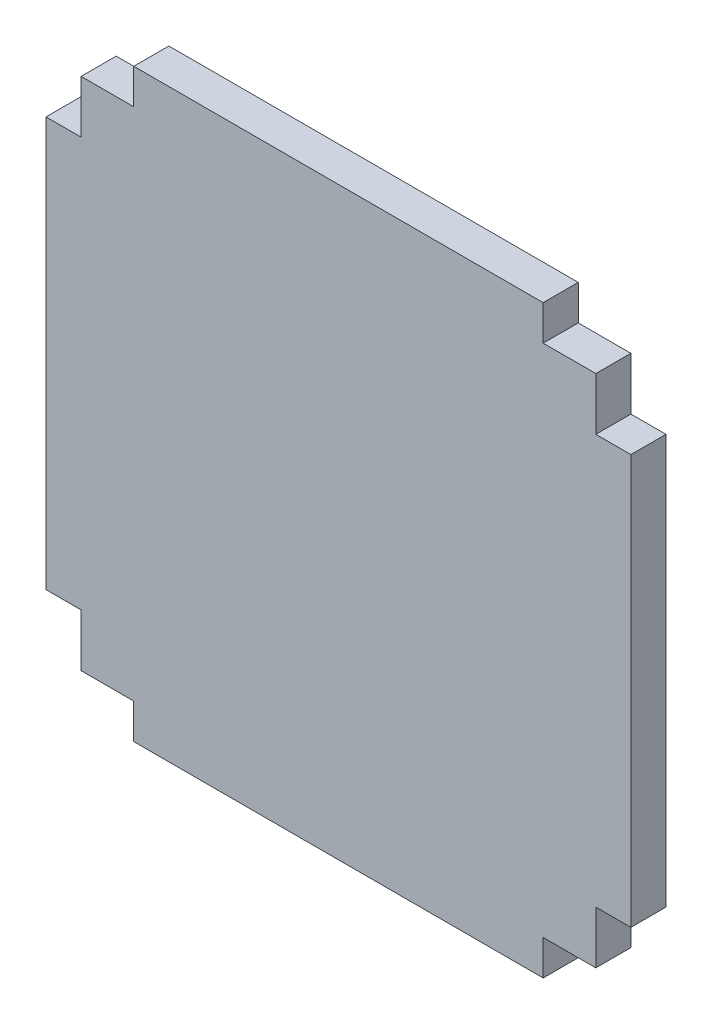
ISO-10303-21;
HEADER;
FILE_DESCRIPTION(('STEP AP214'),'2;1');
FILE_NAME('part.step','',(''),(''),'','','');
FILE_SCHEMA(('AUTOMOTIVE_DESIGN { 1 0 10303 214 1 1 1 1 }'));
ENDSEC;
DATA;
#1=APPLICATION_CONTEXT('core data for automotive mechanical design processes');
#2=APPLICATION_PROTOCOL_DEFINITION('international standard','automotive_design',2000,#1);
#3=PRODUCT_CONTEXT('',#1,'mechanical');
#4=PRODUCT('Part','Part','',(#3));
#5=PRODUCT_RELATED_PRODUCT_CATEGORY('part','',(#4));
#6=PRODUCT_DEFINITION_FORMATION('','',#4);
#7=PRODUCT_DEFINITION_CONTEXT('part definition',#1,'design');
#8=PRODUCT_DEFINITION('design','',#6,#7);
#9=PRODUCT_DEFINITION_SHAPE('','',#8);
#10=(LENGTH_UNIT() NAMED_UNIT(*) SI_UNIT(.MILLI.,.METRE.));
#11=(NAMED_UNIT(*) PLANE_ANGLE_UNIT() SI_UNIT($,.RADIAN.));
#12=(NAMED_UNIT(*) SI_UNIT($,.STERADIAN.) SOLID_ANGLE_UNIT());
#13=UNCERTAINTY_MEASURE_WITH_UNIT(LENGTH_MEASURE(1.E-05),#10,'distance_accuracy_value','');
#14=(GEOMETRIC_REPRESENTATION_CONTEXT(3) GLOBAL_UNCERTAINTY_ASSIGNED_CONTEXT((#13)) GLOBAL_UNIT_ASSIGNED_CONTEXT((#10,
#11,#12)) REPRESENTATION_CONTEXT('',''));
#15=CARTESIAN_POINT('',(0.,0.,0.));
#16=DIRECTION('',(0.,0.,1.));
#17=DIRECTION('',(1.,0.,0.));
#18=AXIS2_PLACEMENT_3D('',#15,#16,#17);
#19=CARTESIAN_POINT('',(22.,0.,3.));
#20=DIRECTION('',(1.,0.,0.));
#21=DIRECTION('',(0.,1.,0.));
#22=AXIS2_PLACEMENT_3D('',#19,#20,#21);
#23=PLANE('',#22);
#24=DIRECTION('',(0.,-1.,0.));
#25=VECTOR('',#24,1.);
#26=CARTESIAN_POINT('',(22.,0.,0.));
#27=LINE('',#26,#25);
#28=CARTESIAN_POINT('',(22.,22.,0.));
#29=VERTEX_POINT('',#28);
#30=CARTESIAN_POINT('',(22.,17.5,0.));
#31=VERTEX_POINT('',#30);
#32=EDGE_CURVE('E202',#29,#31,#27,.T.);
#33=ORIENTED_EDGE('',*,*,#32,.F.);
#34=DIRECTION('',(0.,0.,-1.));
#35=VECTOR('',#34,1.);
#36=CARTESIAN_POINT('',(22.,22.,3.));
#37=LINE('',#36,#35);
#38=CARTESIAN_POINT('',(22.,22.,3.));
#39=VERTEX_POINT('',#38);
#40=EDGE_CURVE('E11',#39,#29,#37,.T.);
#41=ORIENTED_EDGE('',*,*,#40,.F.);
#42=DIRECTION('',(0.,-1.,0.));
#43=VECTOR('',#42,1.);
#44=CARTESIAN_POINT('',(22.,0.,3.));
#45=LINE('',#44,#43);
#46=CARTESIAN_POINT('',(22.,17.5,3.));
#47=VERTEX_POINT('',#46);
#48=EDGE_CURVE('E246',#39,#47,#45,.T.);
#49=ORIENTED_EDGE('',*,*,#48,.T.);
#50=DIRECTION('',(0.,0.,-1.));
#51=VECTOR('',#50,1.);
#52=CARTESIAN_POINT('',(22.,17.5,3.));
#53=LINE('',#52,#51);
#54=EDGE_CURVE('E54',#47,#31,#53,.T.);
#55=ORIENTED_EDGE('',*,*,#54,.T.);
#56=EDGE_LOOP('',(#33,#41,#49,#55));
#57=FACE_BOUND('',#56,.T.);
#58=ADVANCED_FACE('F37',(#57),#23,.T.);
#59=CARTESIAN_POINT('',(0.,22.,3.));
#60=DIRECTION('',(0.,1.,0.));
#61=DIRECTION('',(0.,0.,1.));
#62=AXIS2_PLACEMENT_3D('',#59,#60,#61);
#63=PLANE('',#62);
#64=DIRECTION('',(1.,0.,0.));
#65=VECTOR('',#64,1.);
#66=CARTESIAN_POINT('',(0.,22.,0.));
#67=LINE('',#66,#65);
#68=CARTESIAN_POINT('',(17.5,22.,0.));
#69=VERTEX_POINT('',#68);
#70=EDGE_CURVE('E204',#69,#29,#67,.T.);
#71=ORIENTED_EDGE('',*,*,#70,.F.);
#72=DIRECTION('',(0.,0.,-1.));
#73=VECTOR('',#72,1.);
#74=CARTESIAN_POINT('',(17.5,22.,3.));
#75=LINE('',#74,#73);
#76=CARTESIAN_POINT('',(17.5,22.,3.));
#77=VERTEX_POINT('',#76);
#78=EDGE_CURVE('E46',#77,#69,#75,.T.);
#79=ORIENTED_EDGE('',*,*,#78,.F.);
#80=DIRECTION('',(1.,0.,0.));
#81=VECTOR('',#80,1.);
#82=CARTESIAN_POINT('',(0.,22.,3.));
#83=LINE('',#82,#81);
#84=EDGE_CURVE('E304',#77,#39,#83,.T.);
#85=ORIENTED_EDGE('',*,*,#84,.T.);
#86=ORIENTED_EDGE('',*,*,#40,.T.);
#87=EDGE_LOOP('',(#71,#79,#85,#86));
#88=FACE_BOUND('',#87,.T.);
#89=ADVANCED_FACE('F291',(#88),#63,.T.);
#90=CARTESIAN_POINT('',(17.5,0.,3.));
#91=DIRECTION('',(1.,0.,0.));
#92=DIRECTION('',(0.,0.,-1.));
#93=AXIS2_PLACEMENT_3D('',#90,#91,#92);
#94=PLANE('',#93);
#95=DIRECTION('',(0.,-1.,0.));
#96=VECTOR('',#95,1.);
#97=CARTESIAN_POINT('',(17.5,0.,0.));
#98=LINE('',#97,#96);
#99=CARTESIAN_POINT('',(17.5,25.,0.));
#100=VERTEX_POINT('',#99);
#101=EDGE_CURVE('E208',#100,#69,#98,.T.);
#102=ORIENTED_EDGE('',*,*,#101,.F.);
#103=DIRECTION('',(0.,0.,-1.));
#104=VECTOR('',#103,1.);
#105=CARTESIAN_POINT('',(17.5,25.,3.));
#106=LINE('',#105,#104);
#107=CARTESIAN_POINT('',(17.5,25.,3.));
#108=VERTEX_POINT('',#107);
#109=EDGE_CURVE('E281',#108,#100,#106,.T.);
#110=ORIENTED_EDGE('',*,*,#109,.F.);
#111=DIRECTION('',(0.,-1.,0.));
#112=VECTOR('',#111,1.);
#113=CARTESIAN_POINT('',(17.5,0.,3.));
#114=LINE('',#113,#112);
#115=EDGE_CURVE('E287',#108,#77,#114,.T.);
#116=ORIENTED_EDGE('',*,*,#115,.T.);
#117=ORIENTED_EDGE('',*,*,#78,.T.);
#118=EDGE_LOOP('',(#102,#110,#116,#117));
#119=FACE_BOUND('',#118,.T.);
#120=ADVANCED_FACE('F39',(#119),#94,.T.);
#121=CARTESIAN_POINT('',(0.,25.,3.));
#122=DIRECTION('',(0.,1.,0.));
#123=DIRECTION('',(0.,0.,1.));
#124=AXIS2_PLACEMENT_3D('',#121,#122,#123);
#125=PLANE('',#124);
#126=DIRECTION('',(1.,0.,0.));
#127=VECTOR('',#126,1.);
#128=CARTESIAN_POINT('',(0.,25.,0.));
#129=LINE('',#128,#127);
#130=CARTESIAN_POINT('',(-17.5,25.,0.));
#131=VERTEX_POINT('',#130);
#132=EDGE_CURVE('E212',#131,#100,#129,.T.);
#133=ORIENTED_EDGE('',*,*,#132,.F.);
#134=DIRECTION('',(0.,0.,-1.));
#135=VECTOR('',#134,1.);
#136=CARTESIAN_POINT('',(-17.5,25.,3.));
#137=LINE('',#136,#135);
#138=CARTESIAN_POINT('',(-17.5,25.,3.));
#139=VERTEX_POINT('',#138);
#140=EDGE_CURVE('E279',#139,#131,#137,.T.);
#141=ORIENTED_EDGE('',*,*,#140,.F.);
#142=DIRECTION('',(1.,0.,0.));
#143=VECTOR('',#142,1.);
#144=CARTESIAN_POINT('',(0.,25.,3.));
#145=LINE('',#144,#143);
#146=EDGE_CURVE('E301',#139,#108,#145,.T.);
#147=ORIENTED_EDGE('',*,*,#146,.T.);
#148=ORIENTED_EDGE('',*,*,#109,.T.);
#149=EDGE_LOOP('',(#133,#141,#147,#148));
#150=FACE_BOUND('',#149,.T.);
#151=ADVANCED_FACE('F298',(#150),#125,.T.);
#152=CARTESIAN_POINT('',(-17.5000000000001,0.,3.));
#153=DIRECTION('',(-1.,0.,0.));
#154=DIRECTION('',(0.,-1.,0.));
#155=AXIS2_PLACEMENT_3D('',#152,#153,#154);
#156=PLANE('',#155);
#157=DIRECTION('',(0.,1.,0.));
#158=VECTOR('',#157,1.);
#159=CARTESIAN_POINT('',(-17.5000000000001,0.,0.));
#160=LINE('',#159,#158);
#161=CARTESIAN_POINT('',(-17.5,22.,0.));
#162=VERTEX_POINT('',#161);
#163=EDGE_CURVE('E215',#162,#131,#160,.T.);
#164=ORIENTED_EDGE('',*,*,#163,.F.);
#165=DIRECTION('',(0.,0.,-1.));
#166=VECTOR('',#165,1.);
#167=CARTESIAN_POINT('',(-17.5,22.,3.));
#168=LINE('',#167,#166);
#169=CARTESIAN_POINT('',(-17.5,22.,3.));
#170=VERTEX_POINT('',#169);
#171=EDGE_CURVE('E277',#170,#162,#168,.T.);
#172=ORIENTED_EDGE('',*,*,#171,.F.);
#173=DIRECTION('',(0.,1.,0.));
#174=VECTOR('',#173,1.);
#175=CARTESIAN_POINT('',(-17.5000000000001,0.,3.));
#176=LINE('',#175,#174);
#177=EDGE_CURVE('E306',#170,#139,#176,.T.);
#178=ORIENTED_EDGE('',*,*,#177,.T.);
#179=ORIENTED_EDGE('',*,*,#140,.T.);
#180=EDGE_LOOP('',(#164,#172,#178,#179));
#181=FACE_BOUND('',#180,.T.);
#182=ADVANCED_FACE('F412',(#181),#156,.T.);
#183=CARTESIAN_POINT('',(-22.,22.,0.));
#184=VERTEX_POINT('',#183);
#185=EDGE_CURVE('E209',#184,#162,#67,.T.);
#186=ORIENTED_EDGE('',*,*,#185,.F.);
#187=DIRECTION('',(0.,0.,-1.));
#188=VECTOR('',#187,1.);
#189=CARTESIAN_POINT('',(-22.,22.,3.));
#190=LINE('',#189,#188);
#191=CARTESIAN_POINT('',(-22.,22.,3.));
#192=VERTEX_POINT('',#191);
#193=EDGE_CURVE('E275',#192,#184,#190,.T.);
#194=ORIENTED_EDGE('',*,*,#193,.F.);
#195=EDGE_CURVE('E309',#192,#170,#83,.T.);
#196=ORIENTED_EDGE('',*,*,#195,.T.);
#197=ORIENTED_EDGE('',*,*,#171,.T.);
#198=EDGE_LOOP('',(#186,#194,#196,#197));
#199=FACE_BOUND('',#198,.T.);
#200=ADVANCED_FACE('F354',(#199),#63,.T.);
#201=CARTESIAN_POINT('',(-22.,0.,3.));
#202=DIRECTION('',(1.,0.,0.));
#203=DIRECTION('',(0.,1.,0.));
#204=AXIS2_PLACEMENT_3D('',#201,#202,#203);
#205=PLANE('',#204);
#206=DIRECTION('',(0.,-1.,0.));
#207=VECTOR('',#206,1.);
#208=CARTESIAN_POINT('',(-22.,0.,0.));
#209=LINE('',#208,#207);
#210=CARTESIAN_POINT('',(-22.,17.5,0.));
#211=VERTEX_POINT('',#210);
#212=EDGE_CURVE('E218',#184,#211,#209,.T.);
#213=ORIENTED_EDGE('',*,*,#212,.T.);
#214=DIRECTION('',(0.,0.,-1.));
#215=VECTOR('',#214,1.);
#216=CARTESIAN_POINT('',(-22.,17.5,3.));
#217=LINE('',#216,#215);
#218=CARTESIAN_POINT('',(-22.,17.5,3.));
#219=VERTEX_POINT('',#218);
#220=EDGE_CURVE('E272',#219,#211,#217,.T.);
#221=ORIENTED_EDGE('',*,*,#220,.F.);
#222=DIRECTION('',(0.,-1.,0.));
#223=VECTOR('',#222,1.);
#224=CARTESIAN_POINT('',(-22.,0.,3.));
#225=LINE('',#224,#223);
#226=EDGE_CURVE('E313',#192,#219,#225,.T.);
#227=ORIENTED_EDGE('',*,*,#226,.F.);
#228=ORIENTED_EDGE('',*,*,#193,.T.);
#229=EDGE_LOOP('',(#213,#221,#227,#228));
#230=FACE_BOUND('',#229,.T.);
#231=ADVANCED_FACE('F413',(#230),#205,.F.);
#232=CARTESIAN_POINT('',(0.,17.5,3.));
#233=DIRECTION('',(0.,-1.,0.));
#234=DIRECTION('',(0.,0.,-1.));
#235=AXIS2_PLACEMENT_3D('',#232,#233,#234);
#236=PLANE('',#235);
#237=DIRECTION('',(-1.,0.,0.));
#238=VECTOR('',#237,1.);
#239=CARTESIAN_POINT('',(0.,17.5,0.));
#240=LINE('',#239,#238);
#241=CARTESIAN_POINT('',(-25.,17.5,0.));
#242=VERTEX_POINT('',#241);
#243=EDGE_CURVE('E220',#211,#242,#240,.T.);
#244=ORIENTED_EDGE('',*,*,#243,.T.);
#245=DIRECTION('',(0.,0.,-1.));
#246=VECTOR('',#245,1.);
#247=CARTESIAN_POINT('',(-25.,17.5,3.));
#248=LINE('',#247,#246);
#249=CARTESIAN_POINT('',(-25.,17.5,3.));
#250=VERTEX_POINT('',#249);
#251=EDGE_CURVE('E269',#250,#242,#248,.T.);
#252=ORIENTED_EDGE('',*,*,#251,.F.);
#253=DIRECTION('',(-1.,0.,0.));
#254=VECTOR('',#253,1.);
#255=CARTESIAN_POINT('',(0.,17.5,3.));
#256=LINE('',#255,#254);
#257=EDGE_CURVE('E315',#219,#250,#256,.T.);
#258=ORIENTED_EDGE('',*,*,#257,.F.);
#259=ORIENTED_EDGE('',*,*,#220,.T.);
#260=EDGE_LOOP('',(#244,#252,#258,#259));
#261=FACE_BOUND('',#260,.T.);
#262=ADVANCED_FACE('F402',(#261),#236,.F.);
#263=CARTESIAN_POINT('',(-25.,0.,3.));
#264=DIRECTION('',(1.,0.,0.));
#265=DIRECTION('',(0.,0.,-1.));
#266=AXIS2_PLACEMENT_3D('',#263,#264,#265);
#267=PLANE('',#266);
#268=DIRECTION('',(0.,-1.,0.));
#269=VECTOR('',#268,1.);
#270=CARTESIAN_POINT('',(-25.,0.,0.));
#271=LINE('',#270,#269);
#272=CARTESIAN_POINT('',(-25.,-17.5,0.));
#273=VERTEX_POINT('',#272);
#274=EDGE_CURVE('E223',#242,#273,#271,.T.);
#275=ORIENTED_EDGE('',*,*,#274,.T.);
#276=DIRECTION('',(0.,0.,-1.));
#277=VECTOR('',#276,1.);
#278=CARTESIAN_POINT('',(-25.,-17.5,3.));
#279=LINE('',#278,#277);
#280=CARTESIAN_POINT('',(-25.,-17.5,3.));
#281=VERTEX_POINT('',#280);
#282=EDGE_CURVE('E266',#281,#273,#279,.T.);
#283=ORIENTED_EDGE('',*,*,#282,.F.);
#284=DIRECTION('',(0.,-1.,0.));
#285=VECTOR('',#284,1.);
#286=CARTESIAN_POINT('',(-25.,0.,3.));
#287=LINE('',#286,#285);
#288=EDGE_CURVE('E318',#250,#281,#287,.T.);
#289=ORIENTED_EDGE('',*,*,#288,.F.);
#290=ORIENTED_EDGE('',*,*,#251,.T.);
#291=EDGE_LOOP('',(#275,#283,#289,#290));
#292=FACE_BOUND('',#291,.T.);
#293=ADVANCED_FACE('F398',(#292),#267,.F.);
#294=CARTESIAN_POINT('',(0.,-17.5,3.));
#295=DIRECTION('',(0.,1.,0.));
#296=DIRECTION('',(0.,0.,1.));
#297=AXIS2_PLACEMENT_3D('',#294,#295,#296);
#298=PLANE('',#297);
#299=DIRECTION('',(1.,0.,0.));
#300=VECTOR('',#299,1.);
#301=CARTESIAN_POINT('',(0.,-17.5,0.));
#302=LINE('',#301,#300);
#303=CARTESIAN_POINT('',(-22.,-17.5,0.));
#304=VERTEX_POINT('',#303);
#305=EDGE_CURVE('E225',#273,#304,#302,.T.);
#306=ORIENTED_EDGE('',*,*,#305,.T.);
#307=DIRECTION('',(0.,0.,-1.));
#308=VECTOR('',#307,1.);
#309=CARTESIAN_POINT('',(-22.,-17.5,3.));
#310=LINE('',#309,#308);
#311=CARTESIAN_POINT('',(-22.,-17.5,3.));
#312=VERTEX_POINT('',#311);
#313=EDGE_CURVE('E263',#312,#304,#310,.T.);
#314=ORIENTED_EDGE('',*,*,#313,.F.);
#315=DIRECTION('',(1.,0.,0.));
#316=VECTOR('',#315,1.);
#317=CARTESIAN_POINT('',(0.,-17.5,3.));
#318=LINE('',#317,#316);
#319=EDGE_CURVE('E320',#281,#312,#318,.T.);
#320=ORIENTED_EDGE('',*,*,#319,.F.);
#321=ORIENTED_EDGE('',*,*,#282,.T.);
#322=EDGE_LOOP('',(#306,#314,#320,#321));
#323=FACE_BOUND('',#322,.T.);
#324=ADVANCED_FACE('F393',(#323),#298,.F.);
#325=CARTESIAN_POINT('',(-22.,-22.,0.));
#326=VERTEX_POINT('',#325);
#327=EDGE_CURVE('E221',#304,#326,#209,.T.);
#328=ORIENTED_EDGE('',*,*,#327,.T.);
#329=DIRECTION('',(0.,0.,-1.));
#330=VECTOR('',#329,1.);
#331=CARTESIAN_POINT('',(-22.,-22.,3.));
#332=LINE('',#331,#330);
#333=CARTESIAN_POINT('',(-22.,-22.,3.));
#334=VERTEX_POINT('',#333);
#335=EDGE_CURVE('E260',#334,#326,#332,.T.);
#336=ORIENTED_EDGE('',*,*,#335,.F.);
#337=EDGE_CURVE('E316',#312,#334,#225,.T.);
#338=ORIENTED_EDGE('',*,*,#337,.F.);
#339=ORIENTED_EDGE('',*,*,#313,.T.);
#340=EDGE_LOOP('',(#328,#336,#338,#339));
#341=FACE_BOUND('',#340,.T.);
#342=ADVANCED_FACE('F387',(#341),#205,.F.);
#343=CARTESIAN_POINT('',(0.,-22.,3.));
#344=DIRECTION('',(0.,1.,0.));
#345=DIRECTION('',(0.,0.,1.));
#346=AXIS2_PLACEMENT_3D('',#343,#344,#345);
#347=PLANE('',#346);
#348=DIRECTION('',(1.,0.,0.));
#349=VECTOR('',#348,1.);
#350=CARTESIAN_POINT('',(0.,-22.,0.));
#351=LINE('',#350,#349);
#352=CARTESIAN_POINT('',(-17.5,-22.,0.));
#353=VERTEX_POINT('',#352);
#354=EDGE_CURVE('E227',#326,#353,#351,.T.);
#355=ORIENTED_EDGE('',*,*,#354,.T.);
#356=DIRECTION('',(0.,0.,-1.));
#357=VECTOR('',#356,1.);
#358=CARTESIAN_POINT('',(-17.5,-22.,3.));
#359=LINE('',#358,#357);
#360=CARTESIAN_POINT('',(-17.5,-22.,3.));
#361=VERTEX_POINT('',#360);
#362=EDGE_CURVE('E258',#361,#353,#359,.T.);
#363=ORIENTED_EDGE('',*,*,#362,.F.);
#364=DIRECTION('',(1.,0.,0.));
#365=VECTOR('',#364,1.);
#366=CARTESIAN_POINT('',(0.,-22.,3.));
#367=LINE('',#366,#365);
#368=EDGE_CURVE('E322',#334,#361,#367,.T.);
#369=ORIENTED_EDGE('',*,*,#368,.F.);
#370=ORIENTED_EDGE('',*,*,#335,.T.);
#371=EDGE_LOOP('',(#355,#363,#369,#370));
#372=FACE_BOUND('',#371,.T.);
#373=ADVANCED_FACE('F365',(#372),#347,.F.);
#374=CARTESIAN_POINT('',(-17.5,0.,3.));
#375=DIRECTION('',(-1.,0.,0.));
#376=DIRECTION('',(0.,0.,1.));
#377=AXIS2_PLACEMENT_3D('',#374,#375,#376);
#378=PLANE('',#377);
#379=DIRECTION('',(0.,1.,0.));
#380=VECTOR('',#379,1.);
#381=CARTESIAN_POINT('',(-17.5,0.,0.));
#382=LINE('',#381,#380);
#383=CARTESIAN_POINT('',(-17.5,-25.,0.));
#384=VERTEX_POINT('',#383);
#385=EDGE_CURVE('E230',#384,#353,#382,.T.);
#386=ORIENTED_EDGE('',*,*,#385,.F.);
#387=DIRECTION('',(0.,0.,-1.));
#388=VECTOR('',#387,1.);
#389=CARTESIAN_POINT('',(-17.5,-25.,3.));
#390=LINE('',#389,#388);
#391=CARTESIAN_POINT('',(-17.5,-25.,3.));
#392=VERTEX_POINT('',#391);
#393=EDGE_CURVE('E256',#392,#384,#390,.T.);
#394=ORIENTED_EDGE('',*,*,#393,.F.);
#395=DIRECTION('',(0.,1.,0.));
#396=VECTOR('',#395,1.);
#397=CARTESIAN_POINT('',(-17.5,0.,3.));
#398=LINE('',#397,#396);
#399=EDGE_CURVE('E324',#392,#361,#398,.T.);
#400=ORIENTED_EDGE('',*,*,#399,.T.);
#401=ORIENTED_EDGE('',*,*,#362,.T.);
#402=EDGE_LOOP('',(#386,#394,#400,#401));
#403=FACE_BOUND('',#402,.T.);
#404=ADVANCED_FACE('F379',(#403),#378,.T.);
#405=CARTESIAN_POINT('',(0.,-25.,3.));
#406=DIRECTION('',(0.,-1.,0.));
#407=DIRECTION('',(1.,0.,0.));
#408=AXIS2_PLACEMENT_3D('',#405,#406,#407);
#409=PLANE('',#408);
#410=DIRECTION('',(-1.,0.,0.));
#411=VECTOR('',#410,1.);
#412=CARTESIAN_POINT('',(0.,-25.,0.));
#413=LINE('',#412,#411);
#414=CARTESIAN_POINT('',(17.5,-25.,0.));
#415=VERTEX_POINT('',#414);
#416=EDGE_CURVE('E234',#415,#384,#413,.T.);
#417=ORIENTED_EDGE('',*,*,#416,.F.);
#418=DIRECTION('',(0.,0.,-1.));
#419=VECTOR('',#418,1.);
#420=CARTESIAN_POINT('',(17.5,-25.,3.));
#421=LINE('',#420,#419);
#422=CARTESIAN_POINT('',(17.5,-25.,3.));
#423=VERTEX_POINT('',#422);
#424=EDGE_CURVE('E254',#423,#415,#421,.T.);
#425=ORIENTED_EDGE('',*,*,#424,.F.);
#426=DIRECTION('',(-1.,0.,0.));
#427=VECTOR('',#426,1.);
#428=CARTESIAN_POINT('',(0.,-25.,3.));
#429=LINE('',#428,#427);
#430=EDGE_CURVE('E328',#423,#392,#429,.T.);
#431=ORIENTED_EDGE('',*,*,#430,.T.);
#432=ORIENTED_EDGE('',*,*,#393,.T.);
#433=EDGE_LOOP('',(#417,#425,#431,#432));
#434=FACE_BOUND('',#433,.T.);
#435=ADVANCED_FACE('F374',(#434),#409,.T.);
#436=CARTESIAN_POINT('',(17.5,0.,3.));
#437=DIRECTION('',(1.,0.,0.));
#438=DIRECTION('',(0.,0.,-1.));
#439=AXIS2_PLACEMENT_3D('',#436,#437,#438);
#440=PLANE('',#439);
#441=DIRECTION('',(0.,-1.,0.));
#442=VECTOR('',#441,1.);
#443=CARTESIAN_POINT('',(17.5,0.,0.));
#444=LINE('',#443,#442);
#445=CARTESIAN_POINT('',(17.5,-22.,0.));
#446=VERTEX_POINT('',#445);
#447=EDGE_CURVE('E237',#446,#415,#444,.T.);
#448=ORIENTED_EDGE('',*,*,#447,.F.);
#449=DIRECTION('',(0.,0.,-1.));
#450=VECTOR('',#449,1.);
#451=CARTESIAN_POINT('',(17.5,-22.,3.));
#452=LINE('',#451,#450);
#453=CARTESIAN_POINT('',(17.5,-22.,3.));
#454=VERTEX_POINT('',#453);
#455=EDGE_CURVE('E252',#454,#446,#452,.T.);
#456=ORIENTED_EDGE('',*,*,#455,.F.);
#457=DIRECTION('',(0.,-1.,0.));
#458=VECTOR('',#457,1.);
#459=CARTESIAN_POINT('',(17.5,0.,3.));
#460=LINE('',#459,#458);
#461=EDGE_CURVE('E330',#454,#423,#460,.T.);
#462=ORIENTED_EDGE('',*,*,#461,.T.);
#463=ORIENTED_EDGE('',*,*,#424,.T.);
#464=EDGE_LOOP('',(#448,#456,#462,#463));
#465=FACE_BOUND('',#464,.T.);
#466=ADVANCED_FACE('F363',(#465),#440,.T.);
#467=CARTESIAN_POINT('',(22.,-22.,0.));
#468=VERTEX_POINT('',#467);
#469=EDGE_CURVE('E231',#446,#468,#351,.T.);
#470=ORIENTED_EDGE('',*,*,#469,.T.);
#471=DIRECTION('',(0.,0.,-1.));
#472=VECTOR('',#471,1.);
#473=CARTESIAN_POINT('',(22.,-22.,3.));
#474=LINE('',#473,#472);
#475=CARTESIAN_POINT('',(22.,-22.,3.));
#476=VERTEX_POINT('',#475);
#477=EDGE_CURVE('E250',#476,#468,#474,.T.);
#478=ORIENTED_EDGE('',*,*,#477,.F.);
#479=EDGE_CURVE('E325',#454,#476,#367,.T.);
#480=ORIENTED_EDGE('',*,*,#479,.F.);
#481=ORIENTED_EDGE('',*,*,#455,.T.);
#482=EDGE_LOOP('',(#470,#478,#480,#481));
#483=FACE_BOUND('',#482,.T.);
#484=ADVANCED_FACE('F358',(#483),#347,.F.);
#485=CARTESIAN_POINT('',(22.,-17.5,0.));
#486=VERTEX_POINT('',#485);
#487=EDGE_CURVE('E205',#486,#468,#27,.T.);
#488=ORIENTED_EDGE('',*,*,#487,.F.);
#489=DIRECTION('',(0.,0.,-1.));
#490=VECTOR('',#489,1.);
#491=CARTESIAN_POINT('',(22.,-17.5,3.));
#492=LINE('',#491,#490);
#493=CARTESIAN_POINT('',(22.,-17.5,3.));
#494=VERTEX_POINT('',#493);
#495=EDGE_CURVE('E185',#494,#486,#492,.T.);
#496=ORIENTED_EDGE('',*,*,#495,.F.);
#497=EDGE_CURVE('E194',#494,#476,#45,.T.);
#498=ORIENTED_EDGE('',*,*,#497,.T.);
#499=ORIENTED_EDGE('',*,*,#477,.T.);
#500=EDGE_LOOP('',(#488,#496,#498,#499));
#501=FACE_BOUND('',#500,.T.);
#502=ADVANCED_FACE('F349',(#501),#23,.T.);
#503=CARTESIAN_POINT('',(0.,-17.5,3.));
#504=DIRECTION('',(0.,-1.,0.));
#505=DIRECTION('',(0.,0.,-1.));
#506=AXIS2_PLACEMENT_3D('',#503,#504,#505);
#507=PLANE('',#506);
#508=DIRECTION('',(-1.,0.,0.));
#509=VECTOR('',#508,1.);
#510=CARTESIAN_POINT('',(0.,-17.5,0.));
#511=LINE('',#510,#509);
#512=CARTESIAN_POINT('',(25.,-17.5,0.));
#513=VERTEX_POINT('',#512);
#514=EDGE_CURVE('E181',#513,#486,#511,.T.);
#515=ORIENTED_EDGE('',*,*,#514,.F.);
#516=DIRECTION('',(0.,0.,-1.));
#517=VECTOR('',#516,1.);
#518=CARTESIAN_POINT('',(25.,-17.5,3.));
#519=LINE('',#518,#517);
#520=CARTESIAN_POINT('',(25.,-17.5,3.));
#521=VERTEX_POINT('',#520);
#522=EDGE_CURVE('E176',#521,#513,#519,.T.);
#523=ORIENTED_EDGE('',*,*,#522,.F.);
#524=DIRECTION('',(-1.,0.,0.));
#525=VECTOR('',#524,1.);
#526=CARTESIAN_POINT('',(0.,-17.5,3.));
#527=LINE('',#526,#525);
#528=EDGE_CURVE('E179',#521,#494,#527,.T.);
#529=ORIENTED_EDGE('',*,*,#528,.T.);
#530=ORIENTED_EDGE('',*,*,#495,.T.);
#531=EDGE_LOOP('',(#515,#523,#529,#530));
#532=FACE_BOUND('',#531,.T.);
#533=ADVANCED_FACE('F178',(#532),#507,.T.);
#534=CARTESIAN_POINT('',(25.,0.,3.));
#535=DIRECTION('',(1.,0.,0.));
#536=DIRECTION('',(0.,0.,-1.));
#537=AXIS2_PLACEMENT_3D('',#534,#535,#536);
#538=PLANE('',#537);
#539=DIRECTION('',(0.,-1.,0.));
#540=VECTOR('',#539,1.);
#541=CARTESIAN_POINT('',(25.,0.,0.));
#542=LINE('',#541,#540);
#543=CARTESIAN_POINT('',(25.,17.5,0.));
#544=VERTEX_POINT('',#543);
#545=EDGE_CURVE('E241',#544,#513,#542,.T.);
#546=ORIENTED_EDGE('',*,*,#545,.F.);
#547=DIRECTION('',(0.,0.,-1.));
#548=VECTOR('',#547,1.);
#549=CARTESIAN_POINT('',(25.,17.5,3.));
#550=LINE('',#549,#548);
#551=CARTESIAN_POINT('',(25.,17.5,3.));
#552=VERTEX_POINT('',#551);
#553=EDGE_CURVE('E115',#552,#544,#550,.T.);
#554=ORIENTED_EDGE('',*,*,#553,.F.);
#555=DIRECTION('',(0.,-1.,0.));
#556=VECTOR('',#555,1.);
#557=CARTESIAN_POINT('',(25.,0.,3.));
#558=LINE('',#557,#556);
#559=EDGE_CURVE('E192',#552,#521,#558,.T.);
#560=ORIENTED_EDGE('',*,*,#559,.T.);
#561=ORIENTED_EDGE('',*,*,#522,.T.);
#562=EDGE_LOOP('',(#546,#554,#560,#561));
#563=FACE_BOUND('',#562,.T.);
#564=ADVANCED_FACE('F196',(#563),#538,.T.);
#565=CARTESIAN_POINT('',(0.,17.5,3.));
#566=DIRECTION('',(0.,1.,0.));
#567=DIRECTION('',(0.,0.,1.));
#568=AXIS2_PLACEMENT_3D('',#565,#566,#567);
#569=PLANE('',#568);
#570=DIRECTION('',(1.,0.,0.));
#571=VECTOR('',#570,1.);
#572=CARTESIAN_POINT('',(0.,17.5,0.));
#573=LINE('',#572,#571);
#574=EDGE_CURVE('E243',#31,#544,#573,.T.);
#575=ORIENTED_EDGE('',*,*,#574,.F.);
#576=ORIENTED_EDGE('',*,*,#54,.F.);
#577=DIRECTION('',(1.,0.,0.));
#578=VECTOR('',#577,1.);
#579=CARTESIAN_POINT('',(0.,17.5,3.));
#580=LINE('',#579,#578);
#581=EDGE_CURVE('E197',#47,#552,#580,.T.);
#582=ORIENTED_EDGE('',*,*,#581,.T.);
#583=ORIENTED_EDGE('',*,*,#553,.T.);
#584=EDGE_LOOP('',(#575,#576,#582,#583));
#585=FACE_BOUND('',#584,.T.);
#586=ADVANCED_FACE('F337',(#585),#569,.T.);
#587=CARTESIAN_POINT('',(0.,0.,3.));
#588=DIRECTION('',(0.,0.,1.));
#589=DIRECTION('',(1.,0.,0.));
#590=AXIS2_PLACEMENT_3D('',#587,#588,#589);
#591=PLANE('',#590);
#592=ORIENTED_EDGE('',*,*,#48,.F.);
#593=ORIENTED_EDGE('',*,*,#84,.F.);
#594=ORIENTED_EDGE('',*,*,#115,.F.);
#595=ORIENTED_EDGE('',*,*,#146,.F.);
#596=ORIENTED_EDGE('',*,*,#177,.F.);
#597=ORIENTED_EDGE('',*,*,#195,.F.);
#598=ORIENTED_EDGE('',*,*,#226,.T.);
#599=ORIENTED_EDGE('',*,*,#257,.T.);
#600=ORIENTED_EDGE('',*,*,#288,.T.);
#601=ORIENTED_EDGE('',*,*,#319,.T.);
#602=ORIENTED_EDGE('',*,*,#337,.T.);
#603=ORIENTED_EDGE('',*,*,#368,.T.);
#604=ORIENTED_EDGE('',*,*,#399,.F.);
#605=ORIENTED_EDGE('',*,*,#430,.F.);
#606=ORIENTED_EDGE('',*,*,#461,.F.);
#607=ORIENTED_EDGE('',*,*,#479,.T.);
#608=ORIENTED_EDGE('',*,*,#497,.F.);
#609=ORIENTED_EDGE('',*,*,#528,.F.);
#610=ORIENTED_EDGE('',*,*,#559,.F.);
#611=ORIENTED_EDGE('',*,*,#581,.F.);
#612=EDGE_LOOP('',(#592,#593,#594,#595,#596,#597,#598,#599,#600,#601,#602,#603,#604,#605,#606,
#607,#608,#609,#610,#611));
#613=FACE_BOUND('',#612,.T.);
#614=ADVANCED_FACE('F190',(#613),#591,.T.);
#615=CARTESIAN_POINT('',(0.,0.,0.));
#616=DIRECTION('',(0.,0.,1.));
#617=DIRECTION('',(1.,0.,0.));
#618=AXIS2_PLACEMENT_3D('',#615,#616,#617);
#619=PLANE('',#618);
#620=ORIENTED_EDGE('',*,*,#32,.T.);
#621=ORIENTED_EDGE('',*,*,#574,.T.);
#622=ORIENTED_EDGE('',*,*,#545,.T.);
#623=ORIENTED_EDGE('',*,*,#514,.T.);
#624=ORIENTED_EDGE('',*,*,#487,.T.);
#625=ORIENTED_EDGE('',*,*,#469,.F.);
#626=ORIENTED_EDGE('',*,*,#447,.T.);
#627=ORIENTED_EDGE('',*,*,#416,.T.);
#628=ORIENTED_EDGE('',*,*,#385,.T.);
#629=ORIENTED_EDGE('',*,*,#354,.F.);
#630=ORIENTED_EDGE('',*,*,#327,.F.);
#631=ORIENTED_EDGE('',*,*,#305,.F.);
#632=ORIENTED_EDGE('',*,*,#274,.F.);
#633=ORIENTED_EDGE('',*,*,#243,.F.);
#634=ORIENTED_EDGE('',*,*,#212,.F.);
#635=ORIENTED_EDGE('',*,*,#185,.T.);
#636=ORIENTED_EDGE('',*,*,#163,.T.);
#637=ORIENTED_EDGE('',*,*,#132,.T.);
#638=ORIENTED_EDGE('',*,*,#101,.T.);
#639=ORIENTED_EDGE('',*,*,#70,.T.);
#640=EDGE_LOOP('',(#620,#621,#622,#623,#624,#625,#626,#627,#628,#629,#630,#631,#632,#633,#634,
#635,#636,#637,#638,#639));
#641=FACE_BOUND('',#640,.T.);
#642=ADVANCED_FACE('F293',(#641),#619,.F.);
#643=CLOSED_SHELL('',(#58,#89,#120,#151,#182,#200,#231,#262,#293,#324,#342,#373,#404,#435,#466,
#484,#502,#533,#564,#586,#614,#642));
#644=MANIFOLD_SOLID_BREP('B2',#643);
#645=ADVANCED_BREP_SHAPE_REPRESENTATION('',(#18,#644),#14);
#646=SHAPE_DEFINITION_REPRESENTATION(#9,#645);
ENDSEC;
END-ISO-10303-21;
